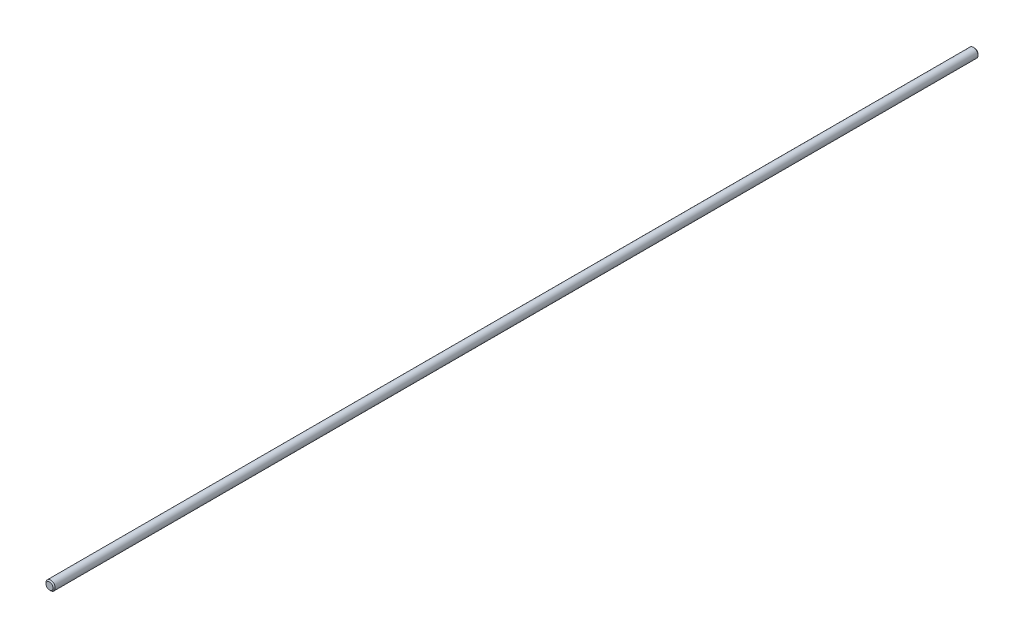
ISO-10303-21;
HEADER;
FILE_DESCRIPTION(('STEP AP214'),'2;1');
FILE_NAME('part.step','',(''),(''),'','','');
FILE_SCHEMA(('AUTOMOTIVE_DESIGN { 1 0 10303 214 1 1 1 1 }'));
ENDSEC;
DATA;
#1=APPLICATION_CONTEXT('core data for automotive mechanical design processes');
#2=APPLICATION_PROTOCOL_DEFINITION('international standard','automotive_design',2000,#1);
#3=PRODUCT_CONTEXT('',#1,'mechanical');
#4=PRODUCT('Part','Part','',(#3));
#5=PRODUCT_RELATED_PRODUCT_CATEGORY('part','',(#4));
#6=PRODUCT_DEFINITION_FORMATION('','',#4);
#7=PRODUCT_DEFINITION_CONTEXT('part definition',#1,'design');
#8=PRODUCT_DEFINITION('design','',#6,#7);
#9=PRODUCT_DEFINITION_SHAPE('','',#8);
#10=(LENGTH_UNIT() NAMED_UNIT(*) SI_UNIT(.MILLI.,.METRE.));
#11=(NAMED_UNIT(*) PLANE_ANGLE_UNIT() SI_UNIT($,.RADIAN.));
#12=(NAMED_UNIT(*) SI_UNIT($,.STERADIAN.) SOLID_ANGLE_UNIT());
#13=UNCERTAINTY_MEASURE_WITH_UNIT(LENGTH_MEASURE(1.E-05),#10,'distance_accuracy_value','');
#14=(GEOMETRIC_REPRESENTATION_CONTEXT(3) GLOBAL_UNCERTAINTY_ASSIGNED_CONTEXT((#13)) GLOBAL_UNIT_ASSIGNED_CONTEXT((#10,
#11,#12)) REPRESENTATION_CONTEXT('',''));
#15=CARTESIAN_POINT('',(0.,0.,0.));
#16=DIRECTION('',(0.,0.,1.));
#17=DIRECTION('',(1.,0.,0.));
#18=AXIS2_PLACEMENT_3D('',#15,#16,#17);
#19=CARTESIAN_POINT('',(0.,0.,250.));
#20=DIRECTION('',(0.,0.,-1.));
#21=DIRECTION('',(-1.,0.,0.));
#22=AXIS2_PLACEMENT_3D('',#19,#20,#21);
#23=PLANE('',#22);
#24=CARTESIAN_POINT('',(0.,0.,250.));
#25=DIRECTION('',(0.,0.,-1.));
#26=DIRECTION('',(-1.,0.,0.));
#27=AXIS2_PLACEMENT_3D('',#24,#25,#26);
#28=CIRCLE('',#27,1.90000000000023);
#29=CARTESIAN_POINT('',(-1.90000000000023,0.,250.));
#30=VERTEX_POINT('',#29);
#31=EDGE_CURVE('E10',#30,#30,#28,.F.);
#32=ORIENTED_EDGE('',*,*,#31,.T.);
#33=EDGE_LOOP('',(#32));
#34=FACE_BOUND('',#33,.T.);
#35=ADVANCED_FACE('F31',(#34),#23,.F.);
#36=CARTESIAN_POINT('',(0.,0.,250.));
#37=DIRECTION('',(0.,0.,1.));
#38=DIRECTION('',(1.,0.,0.));
#39=AXIS2_PLACEMENT_3D('',#36,#37,#38);
#40=CYLINDRICAL_SURFACE('',#39,2.50000000000009);
#41=CARTESIAN_POINT('',(0.,0.,-249.4));
#42=DIRECTION('',(0.,0.,1.));
#43=DIRECTION('',(1.,0.,0.));
#44=AXIS2_PLACEMENT_3D('',#41,#42,#43);
#45=CIRCLE('',#44,2.50000000000009);
#46=CARTESIAN_POINT('',(2.50000000000009,0.,-249.4));
#47=VERTEX_POINT('',#46);
#48=EDGE_CURVE('E42',#47,#47,#45,.T.);
#49=ORIENTED_EDGE('',*,*,#48,.T.);
#50=EDGE_LOOP('',(#49));
#51=FACE_BOUND('',#50,.T.);
#52=CARTESIAN_POINT('',(0.,0.,249.4));
#53=DIRECTION('',(0.,0.,-1.));
#54=DIRECTION('',(-1.,0.,0.));
#55=AXIS2_PLACEMENT_3D('',#52,#53,#54);
#56=CIRCLE('',#55,2.50000000000009);
#57=CARTESIAN_POINT('',(-2.50000000000009,0.,249.4));
#58=VERTEX_POINT('',#57);
#59=EDGE_CURVE('E46',#58,#58,#56,.T.);
#60=ORIENTED_EDGE('',*,*,#59,.T.);
#61=EDGE_LOOP('',(#60));
#62=FACE_BOUND('',#61,.T.);
#63=ADVANCED_FACE('F52',(#51,#62),#40,.T.);
#64=CARTESIAN_POINT('',(0.,0.,-250.));
#65=DIRECTION('',(0.,0.,1.));
#66=DIRECTION('',(1.,0.,0.));
#67=AXIS2_PLACEMENT_3D('',#64,#65,#66);
#68=PLANE('',#67);
#69=CARTESIAN_POINT('',(0.,0.,-250.));
#70=DIRECTION('',(0.,0.,1.));
#71=DIRECTION('',(1.,0.,0.));
#72=AXIS2_PLACEMENT_3D('',#69,#70,#71);
#73=CIRCLE('',#72,1.90000000000007);
#74=CARTESIAN_POINT('',(1.90000000000007,0.,-250.));
#75=VERTEX_POINT('',#74);
#76=EDGE_CURVE('E38',#75,#75,#73,.F.);
#77=ORIENTED_EDGE('',*,*,#76,.T.);
#78=EDGE_LOOP('',(#77));
#79=FACE_BOUND('',#78,.T.);
#80=ADVANCED_FACE('F60',(#79),#68,.F.);
#81=CARTESIAN_POINT('',(0.,0.,-249.4));
#82=DIRECTION('',(0.,0.,1.));
#83=DIRECTION('',(1.,0.,0.));
#84=AXIS2_PLACEMENT_3D('',#81,#82,#83);
#85=CONICAL_SURFACE('',#84,2.50000000000009,0.785398163397477);
#86=ORIENTED_EDGE('',*,*,#76,.F.);
#87=EDGE_LOOP('',(#86));
#88=FACE_BOUND('',#87,.T.);
#89=ORIENTED_EDGE('',*,*,#48,.F.);
#90=EDGE_LOOP('',(#89));
#91=FACE_BOUND('',#90,.T.);
#92=ADVANCED_FACE('F56',(#88,#91),#85,.T.);
#93=CARTESIAN_POINT('',(0.,0.,250.));
#94=DIRECTION('',(0.,0.,-1.));
#95=DIRECTION('',(-1.,0.,0.));
#96=AXIS2_PLACEMENT_3D('',#93,#94,#95);
#97=CONICAL_SURFACE('',#96,1.90000000000023,0.785398163397431);
#98=ORIENTED_EDGE('',*,*,#59,.F.);
#99=EDGE_LOOP('',(#98));
#100=FACE_BOUND('',#99,.T.);
#101=ORIENTED_EDGE('',*,*,#31,.F.);
#102=EDGE_LOOP('',(#101));
#103=FACE_BOUND('',#102,.T.);
#104=ADVANCED_FACE('F33',(#100,#103),#97,.T.);
#105=CLOSED_SHELL('',(#35,#63,#80,#92,#104));
#106=MANIFOLD_SOLID_BREP('B2',#105);
#107=ADVANCED_BREP_SHAPE_REPRESENTATION('',(#18,#106),#14);
#108=SHAPE_DEFINITION_REPRESENTATION(#9,#107);
ENDSEC;
END-ISO-10303-21;
